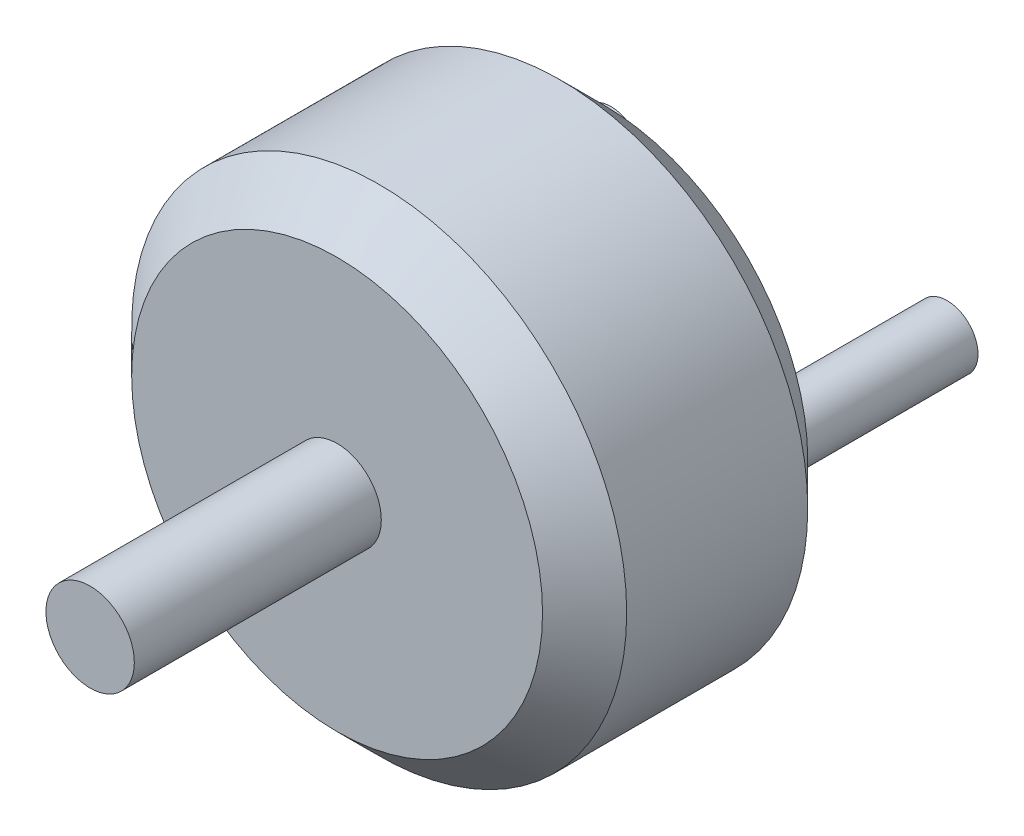
ISO-10303-21;
HEADER;
FILE_DESCRIPTION(('STEP AP214'),'2;1');
FILE_NAME('part.step','',(''),(''),'','','');
FILE_SCHEMA(('AUTOMOTIVE_DESIGN { 1 0 10303 214 1 1 1 1 }'));
ENDSEC;
DATA;
#1=APPLICATION_CONTEXT('core data for automotive mechanical design processes');
#2=APPLICATION_PROTOCOL_DEFINITION('international standard','automotive_design',2000,#1);
#3=PRODUCT_CONTEXT('',#1,'mechanical');
#4=PRODUCT('Part','Part','',(#3));
#5=PRODUCT_RELATED_PRODUCT_CATEGORY('part','',(#4));
#6=PRODUCT_DEFINITION_FORMATION('','',#4);
#7=PRODUCT_DEFINITION_CONTEXT('part definition',#1,'design');
#8=PRODUCT_DEFINITION('design','',#6,#7);
#9=PRODUCT_DEFINITION_SHAPE('','',#8);
#10=(LENGTH_UNIT() NAMED_UNIT(*) SI_UNIT(.MILLI.,.METRE.));
#11=(NAMED_UNIT(*) PLANE_ANGLE_UNIT() SI_UNIT($,.RADIAN.));
#12=(NAMED_UNIT(*) SI_UNIT($,.STERADIAN.) SOLID_ANGLE_UNIT());
#13=UNCERTAINTY_MEASURE_WITH_UNIT(LENGTH_MEASURE(1.E-05),#10,'distance_accuracy_value','');
#14=(GEOMETRIC_REPRESENTATION_CONTEXT(3) GLOBAL_UNCERTAINTY_ASSIGNED_CONTEXT((#13)) GLOBAL_UNIT_ASSIGNED_CONTEXT((#10,
#11,#12)) REPRESENTATION_CONTEXT('',''));
#15=CARTESIAN_POINT('',(0.,0.,0.));
#16=DIRECTION('',(0.,0.,1.));
#17=DIRECTION('',(1.,0.,0.));
#18=AXIS2_PLACEMENT_3D('',#15,#16,#17);
#19=CARTESIAN_POINT('',(0.,0.,15.));
#20=DIRECTION('',(0.,0.,-1.));
#21=DIRECTION('',(-1.,0.,0.));
#22=AXIS2_PLACEMENT_3D('',#19,#20,#21);
#23=CYLINDRICAL_SURFACE('',#22,14.);
#24=CARTESIAN_POINT('',(0.,0.,12.62));
#25=DIRECTION('',(0.,0.,1.));
#26=DIRECTION('',(1.,0.,0.));
#27=AXIS2_PLACEMENT_3D('',#24,#25,#26);
#28=CIRCLE('',#27,14.);
#29=CARTESIAN_POINT('',(14.,0.,12.62));
#30=VERTEX_POINT('',#29);
#31=EDGE_CURVE('E57',#30,#30,#28,.F.);
#32=ORIENTED_EDGE('',*,*,#31,.T.);
#33=EDGE_LOOP('',(#32));
#34=FACE_BOUND('',#33,.T.);
#35=CARTESIAN_POINT('',(0.,0.,2.38));
#36=DIRECTION('',(0.,0.,1.));
#37=DIRECTION('',(1.,0.,0.));
#38=AXIS2_PLACEMENT_3D('',#35,#36,#37);
#39=CIRCLE('',#38,14.);
#40=CARTESIAN_POINT('',(14.,0.,2.38));
#41=VERTEX_POINT('',#40);
#42=EDGE_CURVE('E60',#41,#41,#39,.T.);
#43=ORIENTED_EDGE('',*,*,#42,.T.);
#44=EDGE_LOOP('',(#43));
#45=FACE_BOUND('',#44,.T.);
#46=ADVANCED_FACE('F36',(#34,#45),#23,.T.);
#47=CARTESIAN_POINT('',(0.,0.,15.));
#48=DIRECTION('',(0.,0.,1.));
#49=DIRECTION('',(1.,0.,0.));
#50=AXIS2_PLACEMENT_3D('',#47,#48,#49);
#51=PLANE('',#50);
#52=CARTESIAN_POINT('',(0.,0.,15.));
#53=DIRECTION('',(0.,0.,1.));
#54=DIRECTION('',(1.,0.,0.));
#55=AXIS2_PLACEMENT_3D('',#52,#53,#54);
#56=CIRCLE('',#55,2.5);
#57=CARTESIAN_POINT('',(2.5,0.,15.));
#58=VERTEX_POINT('',#57);
#59=EDGE_CURVE('E48',#58,#58,#56,.T.);
#60=ORIENTED_EDGE('',*,*,#59,.F.);
#61=EDGE_LOOP('',(#60));
#62=FACE_BOUND('',#61,.T.);
#63=CARTESIAN_POINT('',(0.,0.,15.));
#64=DIRECTION('',(0.,0.,1.));
#65=DIRECTION('',(1.,0.,0.));
#66=AXIS2_PLACEMENT_3D('',#63,#64,#65);
#67=CIRCLE('',#66,11.62);
#68=CARTESIAN_POINT('',(11.62,0.,15.));
#69=VERTEX_POINT('',#68);
#70=EDGE_CURVE('E63',#69,#69,#67,.T.);
#71=ORIENTED_EDGE('',*,*,#70,.T.);
#72=EDGE_LOOP('',(#71));
#73=FACE_BOUND('',#72,.T.);
#74=ADVANCED_FACE('F91',(#62,#73),#51,.T.);
#75=CARTESIAN_POINT('',(0.,0.,0.));
#76=DIRECTION('',(0.,0.,1.));
#77=DIRECTION('',(1.,0.,0.));
#78=AXIS2_PLACEMENT_3D('',#75,#76,#77);
#79=PLANE('',#78);
#80=CARTESIAN_POINT('',(-9.5,0.,0.));
#81=DIRECTION('',(0.,0.,1.));
#82=DIRECTION('',(1.,0.,0.));
#83=AXIS2_PLACEMENT_3D('',#80,#81,#82);
#84=CIRCLE('',#83,1.75);
#85=CARTESIAN_POINT('',(-7.75,0.,0.));
#86=VERTEX_POINT('',#85);
#87=EDGE_CURVE('E10',#86,#86,#84,.F.);
#88=ORIENTED_EDGE('',*,*,#87,.F.);
#89=EDGE_LOOP('',(#88));
#90=FACE_BOUND('',#89,.T.);
#91=CARTESIAN_POINT('',(9.5,0.,0.));
#92=DIRECTION('',(0.,0.,1.));
#93=DIRECTION('',(1.,0.,0.));
#94=AXIS2_PLACEMENT_3D('',#91,#92,#93);
#95=CIRCLE('',#94,1.75);
#96=CARTESIAN_POINT('',(11.25,0.,0.));
#97=VERTEX_POINT('',#96);
#98=EDGE_CURVE('E44',#97,#97,#95,.F.);
#99=ORIENTED_EDGE('',*,*,#98,.F.);
#100=EDGE_LOOP('',(#99));
#101=FACE_BOUND('',#100,.T.);
#102=CARTESIAN_POINT('',(0.,0.,0.));
#103=DIRECTION('',(0.,0.,1.));
#104=DIRECTION('',(1.,0.,0.));
#105=AXIS2_PLACEMENT_3D('',#102,#103,#104);
#106=CIRCLE('',#105,11.62);
#107=CARTESIAN_POINT('',(11.62,0.,0.));
#108=VERTEX_POINT('',#107);
#109=EDGE_CURVE('E52',#108,#108,#106,.F.);
#110=ORIENTED_EDGE('',*,*,#109,.T.);
#111=EDGE_LOOP('',(#110));
#112=FACE_BOUND('',#111,.T.);
#113=ADVANCED_FACE('F97',(#90,#101,#112),#79,.F.);
#114=CARTESIAN_POINT('',(0.,0.,15.));
#115=DIRECTION('',(0.,0.,-1.));
#116=DIRECTION('',(-1.,0.,0.));
#117=AXIS2_PLACEMENT_3D('',#114,#115,#116);
#118=CONICAL_SURFACE('',#117,11.62,0.785398163397446);
#119=ORIENTED_EDGE('',*,*,#31,.F.);
#120=EDGE_LOOP('',(#119));
#121=FACE_BOUND('',#120,.T.);
#122=ORIENTED_EDGE('',*,*,#70,.F.);
#123=EDGE_LOOP('',(#122));
#124=FACE_BOUND('',#123,.T.);
#125=ADVANCED_FACE('F103',(#121,#124),#118,.T.);
#126=CARTESIAN_POINT('',(0.,0.,2.38));
#127=DIRECTION('',(0.,0.,1.));
#128=DIRECTION('',(1.,0.,0.));
#129=AXIS2_PLACEMENT_3D('',#126,#127,#128);
#130=CONICAL_SURFACE('',#129,14.,0.785398163397451);
#131=ORIENTED_EDGE('',*,*,#109,.F.);
#132=EDGE_LOOP('',(#131));
#133=FACE_BOUND('',#132,.T.);
#134=ORIENTED_EDGE('',*,*,#42,.F.);
#135=EDGE_LOOP('',(#134));
#136=FACE_BOUND('',#135,.T.);
#137=ADVANCED_FACE('F39',(#133,#136),#130,.T.);
#138=CARTESIAN_POINT('',(0.,0.,28.97));
#139=DIRECTION('',(0.,0.,-1.));
#140=DIRECTION('',(-1.,0.,0.));
#141=AXIS2_PLACEMENT_3D('',#138,#139,#140);
#142=CYLINDRICAL_SURFACE('',#141,2.5);
#143=CARTESIAN_POINT('',(0.,0.,28.97));
#144=DIRECTION('',(0.,0.,1.));
#145=DIRECTION('',(1.,0.,0.));
#146=AXIS2_PLACEMENT_3D('',#143,#144,#145);
#147=CIRCLE('',#146,2.5);
#148=CARTESIAN_POINT('',(2.5,0.,28.97));
#149=VERTEX_POINT('',#148);
#150=EDGE_CURVE('E65',#149,#149,#147,.T.);
#151=ORIENTED_EDGE('',*,*,#150,.F.);
#152=EDGE_LOOP('',(#151));
#153=FACE_BOUND('',#152,.T.);
#154=ORIENTED_EDGE('',*,*,#59,.T.);
#155=EDGE_LOOP('',(#154));
#156=FACE_BOUND('',#155,.T.);
#157=ADVANCED_FACE('F112',(#153,#156),#142,.T.);
#158=CARTESIAN_POINT('',(0.,0.,28.97));
#159=DIRECTION('',(0.,0.,1.));
#160=DIRECTION('',(1.,0.,0.));
#161=AXIS2_PLACEMENT_3D('',#158,#159,#160);
#162=PLANE('',#161);
#163=ORIENTED_EDGE('',*,*,#150,.T.);
#164=EDGE_LOOP('',(#163));
#165=FACE_BOUND('',#164,.T.);
#166=ADVANCED_FACE('F144',(#165),#162,.T.);
#167=CARTESIAN_POINT('',(9.5,0.,-10.));
#168=DIRECTION('',(0.,0.,1.));
#169=DIRECTION('',(1.,0.,0.));
#170=AXIS2_PLACEMENT_3D('',#167,#168,#169);
#171=CYLINDRICAL_SURFACE('',#170,1.75);
#172=CARTESIAN_POINT('',(9.5,0.,-10.));
#173=DIRECTION('',(0.,0.,-1.));
#174=DIRECTION('',(-1.,0.,0.));
#175=AXIS2_PLACEMENT_3D('',#172,#173,#174);
#176=CIRCLE('',#175,1.75);
#177=CARTESIAN_POINT('',(7.75,0.,-10.));
#178=VERTEX_POINT('',#177);
#179=EDGE_CURVE('E69',#178,#178,#176,.T.);
#180=ORIENTED_EDGE('',*,*,#179,.F.);
#181=EDGE_LOOP('',(#180));
#182=FACE_BOUND('',#181,.T.);
#183=ORIENTED_EDGE('',*,*,#98,.T.);
#184=EDGE_LOOP('',(#183));
#185=FACE_BOUND('',#184,.T.);
#186=ADVANCED_FACE('F87',(#182,#185),#171,.T.);
#187=CARTESIAN_POINT('',(9.5,0.,-10.));
#188=DIRECTION('',(0.,0.,-1.));
#189=DIRECTION('',(-1.,0.,0.));
#190=AXIS2_PLACEMENT_3D('',#187,#188,#189);
#191=PLANE('',#190);
#192=ORIENTED_EDGE('',*,*,#179,.T.);
#193=EDGE_LOOP('',(#192));
#194=FACE_BOUND('',#193,.T.);
#195=ADVANCED_FACE('F80',(#194),#191,.T.);
#196=CARTESIAN_POINT('',(-9.5,0.,-10.));
#197=DIRECTION('',(0.,0.,1.));
#198=DIRECTION('',(1.,0.,0.));
#199=AXIS2_PLACEMENT_3D('',#196,#197,#198);
#200=CYLINDRICAL_SURFACE('',#199,1.75);
#201=CARTESIAN_POINT('',(-9.5,0.,-10.));
#202=DIRECTION('',(0.,0.,-1.));
#203=DIRECTION('',(-1.,0.,0.));
#204=AXIS2_PLACEMENT_3D('',#201,#202,#203);
#205=CIRCLE('',#204,1.75);
#206=CARTESIAN_POINT('',(-11.25,0.,-10.));
#207=VERTEX_POINT('',#206);
#208=EDGE_CURVE('E72',#207,#207,#205,.T.);
#209=ORIENTED_EDGE('',*,*,#208,.F.);
#210=EDGE_LOOP('',(#209));
#211=FACE_BOUND('',#210,.T.);
#212=ORIENTED_EDGE('',*,*,#87,.T.);
#213=EDGE_LOOP('',(#212));
#214=FACE_BOUND('',#213,.T.);
#215=ADVANCED_FACE('F78',(#211,#214),#200,.T.);
#216=CARTESIAN_POINT('',(-9.5,0.,-10.));
#217=DIRECTION('',(0.,0.,-1.));
#218=DIRECTION('',(-1.,0.,0.));
#219=AXIS2_PLACEMENT_3D('',#216,#217,#218);
#220=PLANE('',#219);
#221=ORIENTED_EDGE('',*,*,#208,.T.);
#222=EDGE_LOOP('',(#221));
#223=FACE_BOUND('',#222,.T.);
#224=ADVANCED_FACE('F76',(#223),#220,.T.);
#225=CLOSED_SHELL('',(#46,#74,#113,#125,#137,#157,#166,#186,#195,#215,#224));
#226=MANIFOLD_SOLID_BREP('B2',#225);
#227=ADVANCED_BREP_SHAPE_REPRESENTATION('',(#18,#226),#14);
#228=SHAPE_DEFINITION_REPRESENTATION(#9,#227);
ENDSEC;
END-ISO-10303-21;
